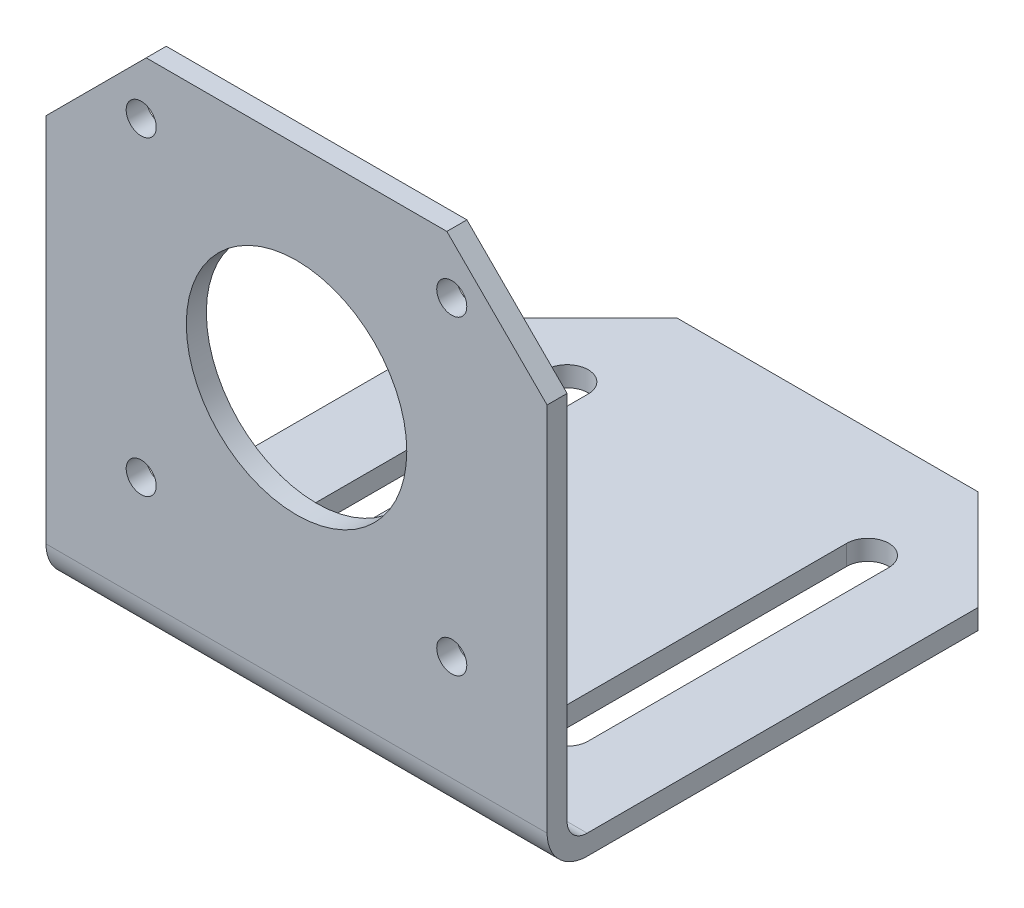
ISO-10303-21;
HEADER;
FILE_DESCRIPTION(('STEP AP214'),'2;1');
FILE_NAME('part.step','',(''),(''),'','','');
FILE_SCHEMA(('AUTOMOTIVE_DESIGN { 1 0 10303 214 1 1 1 1 }'));
ENDSEC;
DATA;
#1=APPLICATION_CONTEXT('core data for automotive mechanical design processes');
#2=APPLICATION_PROTOCOL_DEFINITION('international standard','automotive_design',2000,#1);
#3=PRODUCT_CONTEXT('',#1,'mechanical');
#4=PRODUCT('Part','Part','',(#3));
#5=PRODUCT_RELATED_PRODUCT_CATEGORY('part','',(#4));
#6=PRODUCT_DEFINITION_FORMATION('','',#4);
#7=PRODUCT_DEFINITION_CONTEXT('part definition',#1,'design');
#8=PRODUCT_DEFINITION('design','',#6,#7);
#9=PRODUCT_DEFINITION_SHAPE('','',#8);
#10=(LENGTH_UNIT() NAMED_UNIT(*) SI_UNIT(.MILLI.,.METRE.));
#11=(NAMED_UNIT(*) PLANE_ANGLE_UNIT() SI_UNIT($,.RADIAN.));
#12=(NAMED_UNIT(*) SI_UNIT($,.STERADIAN.) SOLID_ANGLE_UNIT());
#13=UNCERTAINTY_MEASURE_WITH_UNIT(LENGTH_MEASURE(1.E-05),#10,'distance_accuracy_value','');
#14=(GEOMETRIC_REPRESENTATION_CONTEXT(3) GLOBAL_UNCERTAINTY_ASSIGNED_CONTEXT((#13)) GLOBAL_UNIT_ASSIGNED_CONTEXT((#10,
#11,#12)) REPRESENTATION_CONTEXT('',''));
#15=CARTESIAN_POINT('',(0.,0.,0.));
#16=DIRECTION('',(0.,0.,1.));
#17=DIRECTION('',(1.,0.,0.));
#18=AXIS2_PLACEMENT_3D('',#15,#16,#17);
#19=CARTESIAN_POINT('',(50.,4.,-4.));
#20=DIRECTION('',(-1.,0.,0.));
#21=DIRECTION('',(0.,0.,1.));
#22=AXIS2_PLACEMENT_3D('',#19,#20,#21);
#23=CYLINDRICAL_SURFACE('',#22,4.);
#24=CARTESIAN_POINT('',(0.,4.,-4.));
#25=DIRECTION('',(-1.,0.,0.));
#26=DIRECTION('',(0.,0.,1.));
#27=AXIS2_PLACEMENT_3D('',#24,#25,#26);
#28=CIRCLE('',#27,4.);
#29=CARTESIAN_POINT('',(0.,0.,-4.00000000000003));
#30=VERTEX_POINT('',#29);
#31=CARTESIAN_POINT('',(0.,4.00000000000003,0.));
#32=VERTEX_POINT('',#31);
#33=EDGE_CURVE('E190',#30,#32,#28,.T.);
#34=ORIENTED_EDGE('',*,*,#33,.F.);
#35=DIRECTION('',(-1.,0.,0.));
#36=VECTOR('',#35,1.);
#37=CARTESIAN_POINT('',(50.,0.,-4.00000000000003));
#38=LINE('',#37,#36);
#39=CARTESIAN_POINT('',(50.,0.,-4.00000000000003));
#40=VERTEX_POINT('',#39);
#41=EDGE_CURVE('E11',#40,#30,#38,.T.);
#42=ORIENTED_EDGE('',*,*,#41,.F.);
#43=CARTESIAN_POINT('',(50.,4.,-4.));
#44=DIRECTION('',(-1.,0.,0.));
#45=DIRECTION('',(0.,0.,1.));
#46=AXIS2_PLACEMENT_3D('',#43,#44,#45);
#47=CIRCLE('',#46,4.);
#48=CARTESIAN_POINT('',(50.,4.00000000000003,0.));
#49=VERTEX_POINT('',#48);
#50=EDGE_CURVE('E206',#40,#49,#47,.T.);
#51=ORIENTED_EDGE('',*,*,#50,.T.);
#52=DIRECTION('',(-1.,0.,0.));
#53=VECTOR('',#52,1.);
#54=CARTESIAN_POINT('',(50.,4.00000000000003,0.));
#55=LINE('',#54,#53);
#56=EDGE_CURVE('E36',#49,#32,#55,.T.);
#57=ORIENTED_EDGE('',*,*,#56,.T.);
#58=EDGE_LOOP('',(#34,#42,#51,#57));
#59=FACE_BOUND('',#58,.T.);
#60=ADVANCED_FACE('F33',(#59),#23,.T.);
#61=CARTESIAN_POINT('',(50.,0.,-4.00000000000003));
#62=DIRECTION('',(0.,1.,0.));
#63=DIRECTION('',(0.,0.,1.));
#64=AXIS2_PLACEMENT_3D('',#61,#62,#63);
#65=PLANE('',#64);
#66=DIRECTION('',(0.,0.,1.));
#67=VECTOR('',#66,1.);
#68=CARTESIAN_POINT('',(12.1,0.,-42.));
#69=LINE('',#68,#67);
#70=CARTESIAN_POINT('',(12.1,0.,-42.));
#71=VERTEX_POINT('',#70);
#72=CARTESIAN_POINT('',(12.1,0.,-12.));
#73=VERTEX_POINT('',#72);
#74=EDGE_CURVE('E323',#71,#73,#69,.T.);
#75=ORIENTED_EDGE('',*,*,#74,.F.);
#76=CARTESIAN_POINT('',(9.99999999999999,0.,-41.9999999999999));
#77=DIRECTION('',(0.,1.,0.));
#78=DIRECTION('',(0.,0.,1.));
#79=AXIS2_PLACEMENT_3D('',#76,#77,#78);
#80=CIRCLE('',#79,2.1);
#81=CARTESIAN_POINT('',(7.9,0.,-42.));
#82=VERTEX_POINT('',#81);
#83=EDGE_CURVE('E299',#82,#71,#80,.F.);
#84=ORIENTED_EDGE('',*,*,#83,.F.);
#85=DIRECTION('',(0.,0.,-1.));
#86=VECTOR('',#85,1.);
#87=CARTESIAN_POINT('',(7.9,0.,-42.));
#88=LINE('',#87,#86);
#89=CARTESIAN_POINT('',(7.89999999999999,0.,-12.));
#90=VERTEX_POINT('',#89);
#91=EDGE_CURVE('E292',#90,#82,#88,.T.);
#92=ORIENTED_EDGE('',*,*,#91,.F.);
#93=CARTESIAN_POINT('',(9.99999999999999,0.,-12.));
#94=DIRECTION('',(0.,1.,0.));
#95=DIRECTION('',(0.,0.,1.));
#96=AXIS2_PLACEMENT_3D('',#93,#94,#95);
#97=CIRCLE('',#96,2.10000000000001);
#98=EDGE_CURVE('E310',#73,#90,#97,.F.);
#99=ORIENTED_EDGE('',*,*,#98,.F.);
#100=EDGE_LOOP('',(#75,#84,#92,#99));
#101=FACE_BOUND('',#100,.T.);
#102=DIRECTION('',(0.,0.,1.));
#103=VECTOR('',#102,1.);
#104=CARTESIAN_POINT('',(42.1,0.,-42.));
#105=LINE('',#104,#103);
#106=CARTESIAN_POINT('',(42.1,0.,-42.));
#107=VERTEX_POINT('',#106);
#108=CARTESIAN_POINT('',(42.1,0.,-12.));
#109=VERTEX_POINT('',#108);
#110=EDGE_CURVE('E294',#107,#109,#105,.T.);
#111=ORIENTED_EDGE('',*,*,#110,.F.);
#112=CARTESIAN_POINT('',(40.,0.,-41.9999999999999));
#113=DIRECTION('',(0.,1.,0.));
#114=DIRECTION('',(0.,0.,1.));
#115=AXIS2_PLACEMENT_3D('',#112,#113,#114);
#116=CIRCLE('',#115,2.1);
#117=CARTESIAN_POINT('',(37.9,0.,-42.));
#118=VERTEX_POINT('',#117);
#119=EDGE_CURVE('E270',#118,#107,#116,.F.);
#120=ORIENTED_EDGE('',*,*,#119,.F.);
#121=DIRECTION('',(0.,0.,-1.));
#122=VECTOR('',#121,1.);
#123=CARTESIAN_POINT('',(37.9,0.,-42.));
#124=LINE('',#123,#122);
#125=CARTESIAN_POINT('',(37.9,0.,-12.));
#126=VERTEX_POINT('',#125);
#127=EDGE_CURVE('E252',#126,#118,#124,.T.);
#128=ORIENTED_EDGE('',*,*,#127,.F.);
#129=CARTESIAN_POINT('',(40.,0.,-12.));
#130=DIRECTION('',(0.,1.,0.));
#131=DIRECTION('',(0.,0.,1.));
#132=AXIS2_PLACEMENT_3D('',#129,#130,#131);
#133=CIRCLE('',#132,2.10000000000001);
#134=EDGE_CURVE('E281',#109,#126,#133,.F.);
#135=ORIENTED_EDGE('',*,*,#134,.F.);
#136=EDGE_LOOP('',(#111,#120,#128,#135));
#137=FACE_BOUND('',#136,.T.);
#138=DIRECTION('',(-1.,0.,0.));
#139=VECTOR('',#138,1.);
#140=CARTESIAN_POINT('',(50.,0.,-52.9999999999999));
#141=LINE('',#140,#139);
#142=CARTESIAN_POINT('',(40.,0.,-52.9999999999999));
#143=VERTEX_POINT('',#142);
#144=CARTESIAN_POINT('',(10.,0.,-52.9999999999999));
#145=VERTEX_POINT('',#144);
#146=EDGE_CURVE('E41',#143,#145,#141,.T.);
#147=ORIENTED_EDGE('',*,*,#146,.F.);
#148=DIRECTION('',(-0.707106781186548,0.,-0.707106781186548));
#149=VECTOR('',#148,1.);
#150=CARTESIAN_POINT('',(46.5,0.,-46.5));
#151=LINE('',#150,#149);
#152=CARTESIAN_POINT('',(50.,0.,-42.9999999999999));
#153=VERTEX_POINT('',#152);
#154=EDGE_CURVE('E336',#153,#143,#151,.T.);
#155=ORIENTED_EDGE('',*,*,#154,.F.);
#156=DIRECTION('',(0.,0.,-1.));
#157=VECTOR('',#156,1.);
#158=CARTESIAN_POINT('',(50.,0.,-4.00000000000003));
#159=LINE('',#158,#157);
#160=EDGE_CURVE('E218',#40,#153,#159,.T.);
#161=ORIENTED_EDGE('',*,*,#160,.F.);
#162=ORIENTED_EDGE('',*,*,#41,.T.);
#163=DIRECTION('',(0.,0.,-1.));
#164=VECTOR('',#163,1.);
#165=CARTESIAN_POINT('',(0.,0.,-4.00000000000003));
#166=LINE('',#165,#164);
#167=CARTESIAN_POINT('',(0.,0.,-42.9999999999999));
#168=VERTEX_POINT('',#167);
#169=EDGE_CURVE('E204',#30,#168,#166,.T.);
#170=ORIENTED_EDGE('',*,*,#169,.T.);
#171=DIRECTION('',(-0.707106781186548,0.,0.707106781186548));
#172=VECTOR('',#171,1.);
#173=CARTESIAN_POINT('',(-21.5,0.,-21.5));
#174=LINE('',#173,#172);
#175=EDGE_CURVE('E321',#145,#168,#174,.T.);
#176=ORIENTED_EDGE('',*,*,#175,.F.);
#177=EDGE_LOOP('',(#147,#155,#161,#162,#170,#176));
#178=FACE_BOUND('',#177,.T.);
#179=ADVANCED_FACE('F367',(#101,#137,#178),#65,.F.);
#180=CARTESIAN_POINT('',(50.,0.,-52.9999999999999));
#181=DIRECTION('',(0.,0.,1.));
#182=DIRECTION('',(1.,0.,0.));
#183=AXIS2_PLACEMENT_3D('',#180,#181,#182);
#184=PLANE('',#183);
#185=DIRECTION('',(-1.,0.,0.));
#186=VECTOR('',#185,1.);
#187=CARTESIAN_POINT('',(50.,2.,-52.9999999999999));
#188=LINE('',#187,#186);
#189=CARTESIAN_POINT('',(40.,2.,-52.9999999999999));
#190=VERTEX_POINT('',#189);
#191=CARTESIAN_POINT('',(10.,2.,-52.9999999999999));
#192=VERTEX_POINT('',#191);
#193=EDGE_CURVE('E209',#190,#192,#188,.T.);
#194=ORIENTED_EDGE('',*,*,#193,.F.);
#195=DIRECTION('',(0.,1.,0.));
#196=VECTOR('',#195,1.);
#197=CARTESIAN_POINT('',(40.,-14.142135623731,-52.9999999999999));
#198=LINE('',#197,#196);
#199=EDGE_CURVE('E339',#143,#190,#198,.T.);
#200=ORIENTED_EDGE('',*,*,#199,.F.);
#201=ORIENTED_EDGE('',*,*,#146,.T.);
#202=DIRECTION('',(0.,1.,0.));
#203=VECTOR('',#202,1.);
#204=CARTESIAN_POINT('',(10.,-14.142135623731,-52.9999999999999));
#205=LINE('',#204,#203);
#206=EDGE_CURVE('E328',#145,#192,#205,.T.);
#207=ORIENTED_EDGE('',*,*,#206,.T.);
#208=EDGE_LOOP('',(#194,#200,#201,#207));
#209=FACE_BOUND('',#208,.T.);
#210=ADVANCED_FACE('F375',(#209),#184,.F.);
#211=CARTESIAN_POINT('',(50.,2.,-4.00000000000001));
#212=DIRECTION('',(0.,1.,0.));
#213=DIRECTION('',(0.,0.,1.));
#214=AXIS2_PLACEMENT_3D('',#211,#212,#213);
#215=PLANE('',#214);
#216=DIRECTION('',(0.707106781186548,0.,0.707106781186548));
#217=VECTOR('',#216,1.);
#218=CARTESIAN_POINT('',(46.5,2.,-46.5));
#219=LINE('',#218,#217);
#220=CARTESIAN_POINT('',(50.,2.,-42.9999999999999));
#221=VERTEX_POINT('',#220);
#222=EDGE_CURVE('E341',#190,#221,#219,.T.);
#223=ORIENTED_EDGE('',*,*,#222,.F.);
#224=ORIENTED_EDGE('',*,*,#193,.T.);
#225=DIRECTION('',(0.707106781186548,0.,-0.707106781186548));
#226=VECTOR('',#225,1.);
#227=CARTESIAN_POINT('',(-21.5,2.,-21.5));
#228=LINE('',#227,#226);
#229=CARTESIAN_POINT('',(0.,2.,-42.9999999999999));
#230=VERTEX_POINT('',#229);
#231=EDGE_CURVE('E331',#230,#192,#228,.T.);
#232=ORIENTED_EDGE('',*,*,#231,.F.);
#233=DIRECTION('',(0.,0.,-1.));
#234=VECTOR('',#233,1.);
#235=CARTESIAN_POINT('',(0.,2.,-4.00000000000001));
#236=LINE('',#235,#234);
#237=CARTESIAN_POINT('',(0.,2.,-4.00000000000001));
#238=VERTEX_POINT('',#237);
#239=EDGE_CURVE('E201',#238,#230,#236,.T.);
#240=ORIENTED_EDGE('',*,*,#239,.F.);
#241=DIRECTION('',(-1.,0.,0.));
#242=VECTOR('',#241,1.);
#243=CARTESIAN_POINT('',(50.,2.,-4.00000000000001));
#244=LINE('',#243,#242);
#245=CARTESIAN_POINT('',(50.,2.,-4.00000000000001));
#246=VERTEX_POINT('',#245);
#247=EDGE_CURVE('E211',#246,#238,#244,.T.);
#248=ORIENTED_EDGE('',*,*,#247,.F.);
#249=DIRECTION('',(0.,0.,-1.));
#250=VECTOR('',#249,1.);
#251=CARTESIAN_POINT('',(50.,2.,-4.00000000000001));
#252=LINE('',#251,#250);
#253=EDGE_CURVE('E222',#246,#221,#252,.T.);
#254=ORIENTED_EDGE('',*,*,#253,.T.);
#255=EDGE_LOOP('',(#223,#224,#232,#240,#248,#254));
#256=FACE_BOUND('',#255,.T.);
#257=CARTESIAN_POINT('',(9.99999999999999,2.,-41.9999999999999));
#258=DIRECTION('',(0.,1.,0.));
#259=DIRECTION('',(0.,0.,-1.));
#260=AXIS2_PLACEMENT_3D('',#257,#258,#259);
#261=CIRCLE('',#260,2.1);
#262=CARTESIAN_POINT('',(12.1,2.,-42.));
#263=VERTEX_POINT('',#262);
#264=CARTESIAN_POINT('',(7.9,2.,-42.));
#265=VERTEX_POINT('',#264);
#266=EDGE_CURVE('E319',#263,#265,#261,.T.);
#267=ORIENTED_EDGE('',*,*,#266,.F.);
#268=DIRECTION('',(0.,0.,-1.));
#269=VECTOR('',#268,1.);
#270=CARTESIAN_POINT('',(12.1,2.,-42.));
#271=LINE('',#270,#269);
#272=CARTESIAN_POINT('',(12.1,2.,-12.));
#273=VERTEX_POINT('',#272);
#274=EDGE_CURVE('E304',#273,#263,#271,.T.);
#275=ORIENTED_EDGE('',*,*,#274,.F.);
#276=CARTESIAN_POINT('',(9.99999999999999,2.,-12.));
#277=DIRECTION('',(0.,1.,0.));
#278=DIRECTION('',(0.,0.,-1.));
#279=AXIS2_PLACEMENT_3D('',#276,#277,#278);
#280=CIRCLE('',#279,2.10000000000001);
#281=CARTESIAN_POINT('',(7.89999999999999,2.,-12.));
#282=VERTEX_POINT('',#281);
#283=EDGE_CURVE('E313',#282,#273,#280,.T.);
#284=ORIENTED_EDGE('',*,*,#283,.F.);
#285=DIRECTION('',(0.,0.,1.));
#286=VECTOR('',#285,1.);
#287=CARTESIAN_POINT('',(7.9,2.,-42.));
#288=LINE('',#287,#286);
#289=EDGE_CURVE('E316',#265,#282,#288,.T.);
#290=ORIENTED_EDGE('',*,*,#289,.F.);
#291=EDGE_LOOP('',(#267,#275,#284,#290));
#292=FACE_BOUND('',#291,.T.);
#293=CARTESIAN_POINT('',(40.,2.,-41.9999999999999));
#294=DIRECTION('',(0.,1.,0.));
#295=DIRECTION('',(0.,0.,1.));
#296=AXIS2_PLACEMENT_3D('',#293,#294,#295);
#297=CIRCLE('',#296,2.1);
#298=CARTESIAN_POINT('',(42.1,2.,-42.));
#299=VERTEX_POINT('',#298);
#300=CARTESIAN_POINT('',(37.9,2.,-42.));
#301=VERTEX_POINT('',#300);
#302=EDGE_CURVE('E290',#299,#301,#297,.T.);
#303=ORIENTED_EDGE('',*,*,#302,.F.);
#304=DIRECTION('',(0.,0.,-1.));
#305=VECTOR('',#304,1.);
#306=CARTESIAN_POINT('',(42.1,2.,-42.));
#307=LINE('',#306,#305);
#308=CARTESIAN_POINT('',(42.1,2.,-12.));
#309=VERTEX_POINT('',#308);
#310=EDGE_CURVE('E275',#309,#299,#307,.T.);
#311=ORIENTED_EDGE('',*,*,#310,.F.);
#312=CARTESIAN_POINT('',(40.,2.,-12.));
#313=DIRECTION('',(0.,1.,0.));
#314=DIRECTION('',(0.,0.,1.));
#315=AXIS2_PLACEMENT_3D('',#312,#313,#314);
#316=CIRCLE('',#315,2.10000000000001);
#317=CARTESIAN_POINT('',(37.9,2.,-12.));
#318=VERTEX_POINT('',#317);
#319=EDGE_CURVE('E284',#318,#309,#316,.T.);
#320=ORIENTED_EDGE('',*,*,#319,.F.);
#321=DIRECTION('',(0.,0.,1.));
#322=VECTOR('',#321,1.);
#323=CARTESIAN_POINT('',(37.9,2.,-42.));
#324=LINE('',#323,#322);
#325=EDGE_CURVE('E287',#301,#318,#324,.T.);
#326=ORIENTED_EDGE('',*,*,#325,.F.);
#327=EDGE_LOOP('',(#303,#311,#320,#326));
#328=FACE_BOUND('',#327,.T.);
#329=ADVANCED_FACE('F379',(#256,#292,#328),#215,.T.);
#330=CARTESIAN_POINT('',(50.,4.,-4.));
#331=DIRECTION('',(-1.,0.,0.));
#332=DIRECTION('',(0.,0.,1.));
#333=AXIS2_PLACEMENT_3D('',#330,#331,#332);
#334=CYLINDRICAL_SURFACE('',#333,2.);
#335=CARTESIAN_POINT('',(0.,4.,-4.));
#336=DIRECTION('',(1.,0.,0.));
#337=DIRECTION('',(0.,0.,-1.));
#338=AXIS2_PLACEMENT_3D('',#335,#336,#337);
#339=CIRCLE('',#338,2.);
#340=CARTESIAN_POINT('',(0.,4.00000000000001,-2.));
#341=VERTEX_POINT('',#340);
#342=EDGE_CURVE('E193',#341,#238,#339,.T.);
#343=ORIENTED_EDGE('',*,*,#342,.F.);
#344=DIRECTION('',(-1.,0.,0.));
#345=VECTOR('',#344,1.);
#346=CARTESIAN_POINT('',(50.,4.00000000000001,-2.));
#347=LINE('',#346,#345);
#348=CARTESIAN_POINT('',(50.,4.00000000000001,-2.));
#349=VERTEX_POINT('',#348);
#350=EDGE_CURVE('E213',#349,#341,#347,.T.);
#351=ORIENTED_EDGE('',*,*,#350,.F.);
#352=CARTESIAN_POINT('',(50.,4.,-4.));
#353=DIRECTION('',(1.,0.,0.));
#354=DIRECTION('',(0.,0.,-1.));
#355=AXIS2_PLACEMENT_3D('',#352,#353,#354);
#356=CIRCLE('',#355,2.);
#357=EDGE_CURVE('E228',#349,#246,#356,.T.);
#358=ORIENTED_EDGE('',*,*,#357,.T.);
#359=ORIENTED_EDGE('',*,*,#247,.T.);
#360=EDGE_LOOP('',(#343,#351,#358,#359));
#361=FACE_BOUND('',#360,.T.);
#362=ADVANCED_FACE('F390',(#361),#334,.F.);
#363=CARTESIAN_POINT('',(50.,51.,-2.));
#364=DIRECTION('',(0.,0.,-1.));
#365=DIRECTION('',(-1.,0.,0.));
#366=AXIS2_PLACEMENT_3D('',#363,#364,#365);
#367=PLANE('',#366);
#368=DIRECTION('',(-0.707106781186547,-0.707106781186548,0.));
#369=VECTOR('',#368,1.);
#370=CARTESIAN_POINT('',(10.,51.,-2.));
#371=LINE('',#370,#369);
#372=CARTESIAN_POINT('',(10.,51.,-2.));
#373=VERTEX_POINT('',#372);
#374=CARTESIAN_POINT('',(0.,41.,-2.));
#375=VERTEX_POINT('',#374);
#376=EDGE_CURVE('E49',#373,#375,#371,.T.);
#377=ORIENTED_EDGE('',*,*,#376,.F.);
#378=DIRECTION('',(-1.,0.,0.));
#379=VECTOR('',#378,1.);
#380=CARTESIAN_POINT('',(50.,51.,-2.));
#381=LINE('',#380,#379);
#382=CARTESIAN_POINT('',(40.,51.,-2.));
#383=VERTEX_POINT('',#382);
#384=EDGE_CURVE('E216',#383,#373,#381,.T.);
#385=ORIENTED_EDGE('',*,*,#384,.F.);
#386=DIRECTION('',(-0.707106781186548,0.707106781186548,0.));
#387=VECTOR('',#386,1.);
#388=CARTESIAN_POINT('',(50.,41.,-2.));
#389=LINE('',#388,#387);
#390=CARTESIAN_POINT('',(50.,41.,-2.));
#391=VERTEX_POINT('',#390);
#392=EDGE_CURVE('E347',#391,#383,#389,.T.);
#393=ORIENTED_EDGE('',*,*,#392,.F.);
#394=DIRECTION('',(0.,-1.,0.));
#395=VECTOR('',#394,1.);
#396=CARTESIAN_POINT('',(50.,51.,-2.));
#397=LINE('',#396,#395);
#398=EDGE_CURVE('E233',#391,#349,#397,.T.);
#399=ORIENTED_EDGE('',*,*,#398,.T.);
#400=ORIENTED_EDGE('',*,*,#350,.T.);
#401=DIRECTION('',(0.,-1.,0.));
#402=VECTOR('',#401,1.);
#403=CARTESIAN_POINT('',(0.,51.,-2.));
#404=LINE('',#403,#402);
#405=EDGE_CURVE('E191',#375,#341,#404,.T.);
#406=ORIENTED_EDGE('',*,*,#405,.F.);
#407=EDGE_LOOP('',(#377,#385,#393,#399,#400,#406));
#408=FACE_BOUND('',#407,.T.);
#409=CARTESIAN_POINT('',(9.5,45.5,-2.));
#410=DIRECTION('',(0.,0.,-1.));
#411=DIRECTION('',(-1.,0.,0.));
#412=AXIS2_PLACEMENT_3D('',#409,#410,#411);
#413=CIRCLE('',#412,1.5);
#414=CARTESIAN_POINT('',(8.,45.5,-2.));
#415=VERTEX_POINT('',#414);
#416=EDGE_CURVE('E262',#415,#415,#413,.T.);
#417=ORIENTED_EDGE('',*,*,#416,.F.);
#418=EDGE_LOOP('',(#417));
#419=FACE_BOUND('',#418,.T.);
#420=CARTESIAN_POINT('',(40.488,45.4999999999998,-2.));
#421=DIRECTION('',(0.,0.,-1.));
#422=DIRECTION('',(-1.,0.,0.));
#423=AXIS2_PLACEMENT_3D('',#420,#421,#422);
#424=CIRCLE('',#423,1.5);
#425=CARTESIAN_POINT('',(38.988,45.4999999999998,-2.));
#426=VERTEX_POINT('',#425);
#427=EDGE_CURVE('E256',#426,#426,#424,.T.);
#428=ORIENTED_EDGE('',*,*,#427,.F.);
#429=EDGE_LOOP('',(#428));
#430=FACE_BOUND('',#429,.T.);
#431=CARTESIAN_POINT('',(40.4879999999997,14.4999999999998,-2.));
#432=DIRECTION('',(0.,0.,-1.));
#433=DIRECTION('',(-1.,0.,0.));
#434=AXIS2_PLACEMENT_3D('',#431,#432,#433);
#435=CIRCLE('',#434,1.5);
#436=CARTESIAN_POINT('',(38.9879999999997,14.4999999999998,-2.));
#437=VERTEX_POINT('',#436);
#438=EDGE_CURVE('E248',#437,#437,#435,.T.);
#439=ORIENTED_EDGE('',*,*,#438,.F.);
#440=EDGE_LOOP('',(#439));
#441=FACE_BOUND('',#440,.T.);
#442=CARTESIAN_POINT('',(9.49999999999967,14.5,-2.));
#443=DIRECTION('',(0.,0.,-1.));
#444=DIRECTION('',(-1.,0.,0.));
#445=AXIS2_PLACEMENT_3D('',#442,#443,#444);
#446=CIRCLE('',#445,1.5);
#447=CARTESIAN_POINT('',(7.99999999999967,14.5,-2.));
#448=VERTEX_POINT('',#447);
#449=EDGE_CURVE('E249',#448,#448,#446,.T.);
#450=ORIENTED_EDGE('',*,*,#449,.F.);
#451=EDGE_LOOP('',(#450));
#452=FACE_BOUND('',#451,.T.);
#453=CARTESIAN_POINT('',(25.,30.,-2.));
#454=DIRECTION('',(0.,0.,-1.));
#455=DIRECTION('',(-1.,0.,0.));
#456=AXIS2_PLACEMENT_3D('',#453,#454,#455);
#457=CIRCLE('',#456,11.);
#458=CARTESIAN_POINT('',(14.,30.,-2.));
#459=VERTEX_POINT('',#458);
#460=EDGE_CURVE('E241',#459,#459,#457,.T.);
#461=ORIENTED_EDGE('',*,*,#460,.F.);
#462=EDGE_LOOP('',(#461));
#463=FACE_BOUND('',#462,.T.);
#464=ADVANCED_FACE('F356',(#408,#419,#430,#441,#452,#463),#367,.T.);
#465=CARTESIAN_POINT('',(50.,51.,0.));
#466=DIRECTION('',(0.,1.,0.));
#467=DIRECTION('',(0.,0.,1.));
#468=AXIS2_PLACEMENT_3D('',#465,#466,#467);
#469=PLANE('',#468);
#470=DIRECTION('',(0.,0.,-1.));
#471=VECTOR('',#470,1.);
#472=CARTESIAN_POINT('',(10.,51.,14.142135623731));
#473=LINE('',#472,#471);
#474=CARTESIAN_POINT('',(10.,51.,0.));
#475=VERTEX_POINT('',#474);
#476=EDGE_CURVE('E175',#475,#373,#473,.T.);
#477=ORIENTED_EDGE('',*,*,#476,.F.);
#478=DIRECTION('',(-1.,0.,0.));
#479=VECTOR('',#478,1.);
#480=CARTESIAN_POINT('',(50.,51.,0.));
#481=LINE('',#480,#479);
#482=CARTESIAN_POINT('',(40.,51.,0.));
#483=VERTEX_POINT('',#482);
#484=EDGE_CURVE('E185',#483,#475,#481,.T.);
#485=ORIENTED_EDGE('',*,*,#484,.F.);
#486=DIRECTION('',(0.,0.,-1.));
#487=VECTOR('',#486,1.);
#488=CARTESIAN_POINT('',(40.,51.,14.142135623731));
#489=LINE('',#488,#487);
#490=EDGE_CURVE('E344',#483,#383,#489,.T.);
#491=ORIENTED_EDGE('',*,*,#490,.T.);
#492=ORIENTED_EDGE('',*,*,#384,.T.);
#493=EDGE_LOOP('',(#477,#485,#491,#492));
#494=FACE_BOUND('',#493,.T.);
#495=ADVANCED_FACE('F359',(#494),#469,.T.);
#496=CARTESIAN_POINT('',(50.,4.00000000000003,0.));
#497=DIRECTION('',(0.,0.,1.));
#498=DIRECTION('',(1.,0.,0.));
#499=AXIS2_PLACEMENT_3D('',#496,#497,#498);
#500=PLANE('',#499);
#501=DIRECTION('',(-0.707106781186547,-0.707106781186548,0.));
#502=VECTOR('',#501,1.);
#503=CARTESIAN_POINT('',(10.,51.,0.));
#504=LINE('',#503,#502);
#505=CARTESIAN_POINT('',(0.,41.,0.));
#506=VERTEX_POINT('',#505);
#507=EDGE_CURVE('E170',#475,#506,#504,.T.);
#508=ORIENTED_EDGE('',*,*,#507,.T.);
#509=DIRECTION('',(0.,1.,0.));
#510=VECTOR('',#509,1.);
#511=CARTESIAN_POINT('',(0.,4.00000000000003,0.));
#512=LINE('',#511,#510);
#513=EDGE_CURVE('E182',#32,#506,#512,.T.);
#514=ORIENTED_EDGE('',*,*,#513,.F.);
#515=ORIENTED_EDGE('',*,*,#56,.F.);
#516=DIRECTION('',(0.,1.,0.));
#517=VECTOR('',#516,1.);
#518=CARTESIAN_POINT('',(50.,4.00000000000003,0.));
#519=LINE('',#518,#517);
#520=CARTESIAN_POINT('',(50.,41.,0.));
#521=VERTEX_POINT('',#520);
#522=EDGE_CURVE('E235',#49,#521,#519,.T.);
#523=ORIENTED_EDGE('',*,*,#522,.T.);
#524=DIRECTION('',(-0.707106781186548,0.707106781186548,0.));
#525=VECTOR('',#524,1.);
#526=CARTESIAN_POINT('',(50.,41.,0.));
#527=LINE('',#526,#525);
#528=EDGE_CURVE('E57',#521,#483,#527,.T.);
#529=ORIENTED_EDGE('',*,*,#528,.T.);
#530=ORIENTED_EDGE('',*,*,#484,.T.);
#531=EDGE_LOOP('',(#508,#514,#515,#523,#529,#530));
#532=FACE_BOUND('',#531,.T.);
#533=CARTESIAN_POINT('',(9.5,45.5,0.));
#534=DIRECTION('',(0.,0.,1.));
#535=DIRECTION('',(1.,0.,0.));
#536=AXIS2_PLACEMENT_3D('',#533,#534,#535);
#537=CIRCLE('',#536,1.5);
#538=CARTESIAN_POINT('',(11.,45.5,0.));
#539=VERTEX_POINT('',#538);
#540=EDGE_CURVE('E244',#539,#539,#537,.F.);
#541=ORIENTED_EDGE('',*,*,#540,.T.);
#542=EDGE_LOOP('',(#541));
#543=FACE_BOUND('',#542,.T.);
#544=CARTESIAN_POINT('',(40.488,45.4999999999998,0.));
#545=DIRECTION('',(0.,0.,1.));
#546=DIRECTION('',(1.,0.,0.));
#547=AXIS2_PLACEMENT_3D('',#544,#545,#546);
#548=CIRCLE('',#547,1.5);
#549=CARTESIAN_POINT('',(41.988,45.4999999999998,0.));
#550=VERTEX_POINT('',#549);
#551=EDGE_CURVE('E259',#550,#550,#548,.F.);
#552=ORIENTED_EDGE('',*,*,#551,.T.);
#553=EDGE_LOOP('',(#552));
#554=FACE_BOUND('',#553,.T.);
#555=CARTESIAN_POINT('',(40.4879999999997,14.4999999999998,0.));
#556=DIRECTION('',(0.,0.,1.));
#557=DIRECTION('',(1.,0.,0.));
#558=AXIS2_PLACEMENT_3D('',#555,#556,#557);
#559=CIRCLE('',#558,1.5);
#560=CARTESIAN_POINT('',(41.9879999999997,14.4999999999998,0.));
#561=VERTEX_POINT('',#560);
#562=EDGE_CURVE('E253',#561,#561,#559,.F.);
#563=ORIENTED_EDGE('',*,*,#562,.T.);
#564=EDGE_LOOP('',(#563));
#565=FACE_BOUND('',#564,.T.);
#566=CARTESIAN_POINT('',(9.49999999999967,14.5,0.));
#567=DIRECTION('',(0.,0.,1.));
#568=DIRECTION('',(1.,0.,0.));
#569=AXIS2_PLACEMENT_3D('',#566,#567,#568);
#570=CIRCLE('',#569,1.5);
#571=CARTESIAN_POINT('',(10.9999999999997,14.5,0.));
#572=VERTEX_POINT('',#571);
#573=EDGE_CURVE('E245',#572,#572,#570,.F.);
#574=ORIENTED_EDGE('',*,*,#573,.T.);
#575=EDGE_LOOP('',(#574));
#576=FACE_BOUND('',#575,.T.);
#577=CARTESIAN_POINT('',(25.,30.,0.));
#578=DIRECTION('',(0.,0.,1.));
#579=DIRECTION('',(1.,0.,0.));
#580=AXIS2_PLACEMENT_3D('',#577,#578,#579);
#581=CIRCLE('',#580,11.);
#582=CARTESIAN_POINT('',(36.,30.,0.));
#583=VERTEX_POINT('',#582);
#584=EDGE_CURVE('E195',#583,#583,#581,.F.);
#585=ORIENTED_EDGE('',*,*,#584,.T.);
#586=EDGE_LOOP('',(#585));
#587=FACE_BOUND('',#586,.T.);
#588=ADVANCED_FACE('F180',(#532,#543,#554,#565,#576,#587),#500,.T.);
#589=CARTESIAN_POINT('',(50.,4.,-4.));
#590=DIRECTION('',(-1.,0.,0.));
#591=DIRECTION('',(0.,0.,1.));
#592=AXIS2_PLACEMENT_3D('',#589,#590,#591);
#593=PLANE('',#592);
#594=ORIENTED_EDGE('',*,*,#398,.F.);
#595=DIRECTION('',(0.,0.,-1.));
#596=VECTOR('',#595,1.);
#597=CARTESIAN_POINT('',(50.,41.,14.142135623731));
#598=LINE('',#597,#596);
#599=EDGE_CURVE('E345',#521,#391,#598,.T.);
#600=ORIENTED_EDGE('',*,*,#599,.F.);
#601=ORIENTED_EDGE('',*,*,#522,.F.);
#602=ORIENTED_EDGE('',*,*,#50,.F.);
#603=ORIENTED_EDGE('',*,*,#160,.T.);
#604=DIRECTION('',(0.,1.,0.));
#605=VECTOR('',#604,1.);
#606=CARTESIAN_POINT('',(50.,-14.142135623731,-42.9999999999999));
#607=LINE('',#606,#605);
#608=EDGE_CURVE('E338',#153,#221,#607,.T.);
#609=ORIENTED_EDGE('',*,*,#608,.T.);
#610=ORIENTED_EDGE('',*,*,#253,.F.);
#611=ORIENTED_EDGE('',*,*,#357,.F.);
#612=EDGE_LOOP('',(#594,#600,#601,#602,#603,#609,#610,#611));
#613=FACE_BOUND('',#612,.T.);
#614=ADVANCED_FACE('F363',(#613),#593,.F.);
#615=CARTESIAN_POINT('',(0.,4.,-4.));
#616=DIRECTION('',(-1.,0.,0.));
#617=DIRECTION('',(0.,0.,1.));
#618=AXIS2_PLACEMENT_3D('',#615,#616,#617);
#619=PLANE('',#618);
#620=DIRECTION('',(0.,0.,-1.));
#621=VECTOR('',#620,1.);
#622=CARTESIAN_POINT('',(0.,41.,14.142135623731));
#623=LINE('',#622,#621);
#624=EDGE_CURVE('E167',#506,#375,#623,.T.);
#625=ORIENTED_EDGE('',*,*,#624,.T.);
#626=ORIENTED_EDGE('',*,*,#405,.T.);
#627=ORIENTED_EDGE('',*,*,#342,.T.);
#628=ORIENTED_EDGE('',*,*,#239,.T.);
#629=DIRECTION('',(0.,1.,0.));
#630=VECTOR('',#629,1.);
#631=CARTESIAN_POINT('',(0.,-14.142135623731,-42.9999999999999));
#632=LINE('',#631,#630);
#633=EDGE_CURVE('E329',#168,#230,#632,.T.);
#634=ORIENTED_EDGE('',*,*,#633,.F.);
#635=ORIENTED_EDGE('',*,*,#169,.F.);
#636=ORIENTED_EDGE('',*,*,#33,.T.);
#637=ORIENTED_EDGE('',*,*,#513,.T.);
#638=EDGE_LOOP('',(#625,#626,#627,#628,#634,#635,#636,#637));
#639=FACE_BOUND('',#638,.T.);
#640=ADVANCED_FACE('F187',(#639),#619,.T.);
#641=CARTESIAN_POINT('',(25.,30.,31.1126983722081));
#642=DIRECTION('',(0.,0.,-1.));
#643=DIRECTION('',(-1.,0.,0.));
#644=AXIS2_PLACEMENT_3D('',#641,#642,#643);
#645=CYLINDRICAL_SURFACE('',#644,11.);
#646=ORIENTED_EDGE('',*,*,#460,.T.);
#647=EDGE_LOOP('',(#646));
#648=FACE_BOUND('',#647,.T.);
#649=ORIENTED_EDGE('',*,*,#584,.F.);
#650=EDGE_LOOP('',(#649));
#651=FACE_BOUND('',#650,.T.);
#652=ADVANCED_FACE('F414',(#648,#651),#645,.F.);
#653=CARTESIAN_POINT('',(9.49999999999967,14.5,31.1126983722081));
#654=DIRECTION('',(0.,0.,-1.));
#655=DIRECTION('',(-1.,0.,0.));
#656=AXIS2_PLACEMENT_3D('',#653,#654,#655);
#657=CYLINDRICAL_SURFACE('',#656,1.5);
#658=ORIENTED_EDGE('',*,*,#449,.T.);
#659=EDGE_LOOP('',(#658));
#660=FACE_BOUND('',#659,.T.);
#661=ORIENTED_EDGE('',*,*,#573,.F.);
#662=EDGE_LOOP('',(#661));
#663=FACE_BOUND('',#662,.T.);
#664=ADVANCED_FACE('F419',(#660,#663),#657,.F.);
#665=CARTESIAN_POINT('',(40.4879999999997,14.4999999999998,31.1126983722081));
#666=DIRECTION('',(0.,0.,-1.));
#667=DIRECTION('',(-1.,0.,0.));
#668=AXIS2_PLACEMENT_3D('',#665,#666,#667);
#669=CYLINDRICAL_SURFACE('',#668,1.5);
#670=ORIENTED_EDGE('',*,*,#438,.T.);
#671=EDGE_LOOP('',(#670));
#672=FACE_BOUND('',#671,.T.);
#673=ORIENTED_EDGE('',*,*,#562,.F.);
#674=EDGE_LOOP('',(#673));
#675=FACE_BOUND('',#674,.T.);
#676=ADVANCED_FACE('F423',(#672,#675),#669,.F.);
#677=CARTESIAN_POINT('',(40.488,45.4999999999998,31.1126983722081));
#678=DIRECTION('',(0.,0.,-1.));
#679=DIRECTION('',(-1.,0.,0.));
#680=AXIS2_PLACEMENT_3D('',#677,#678,#679);
#681=CYLINDRICAL_SURFACE('',#680,1.5);
#682=ORIENTED_EDGE('',*,*,#427,.T.);
#683=EDGE_LOOP('',(#682));
#684=FACE_BOUND('',#683,.T.);
#685=ORIENTED_EDGE('',*,*,#551,.F.);
#686=EDGE_LOOP('',(#685));
#687=FACE_BOUND('',#686,.T.);
#688=ADVANCED_FACE('F427',(#684,#687),#681,.F.);
#689=CARTESIAN_POINT('',(9.5,45.5,31.1126983722081));
#690=DIRECTION('',(0.,0.,-1.));
#691=DIRECTION('',(-1.,0.,0.));
#692=AXIS2_PLACEMENT_3D('',#689,#690,#691);
#693=CYLINDRICAL_SURFACE('',#692,1.5);
#694=ORIENTED_EDGE('',*,*,#416,.T.);
#695=EDGE_LOOP('',(#694));
#696=FACE_BOUND('',#695,.T.);
#697=ORIENTED_EDGE('',*,*,#540,.F.);
#698=EDGE_LOOP('',(#697));
#699=FACE_BOUND('',#698,.T.);
#700=ADVANCED_FACE('F431',(#696,#699),#693,.F.);
#701=CARTESIAN_POINT('',(40.,-34.4569296368669,-41.9999999999999));
#702=DIRECTION('',(0.,1.,0.));
#703=DIRECTION('',(0.,0.,1.));
#704=AXIS2_PLACEMENT_3D('',#701,#702,#703);
#705=CYLINDRICAL_SURFACE('',#704,2.1);
#706=ORIENTED_EDGE('',*,*,#119,.T.);
#707=DIRECTION('',(0.,1.,0.));
#708=VECTOR('',#707,1.);
#709=CARTESIAN_POINT('',(42.1,-34.4569296368669,-42.));
#710=LINE('',#709,#708);
#711=EDGE_CURVE('E279',#107,#299,#710,.T.);
#712=ORIENTED_EDGE('',*,*,#711,.T.);
#713=ORIENTED_EDGE('',*,*,#302,.T.);
#714=DIRECTION('',(0.,1.,0.));
#715=VECTOR('',#714,1.);
#716=CARTESIAN_POINT('',(37.9,-34.4569296368669,-42.));
#717=LINE('',#716,#715);
#718=EDGE_CURVE('E271',#118,#301,#717,.T.);
#719=ORIENTED_EDGE('',*,*,#718,.F.);
#720=EDGE_LOOP('',(#706,#712,#713,#719));
#721=FACE_BOUND('',#720,.T.);
#722=ADVANCED_FACE('F435',(#721),#705,.F.);
#723=CARTESIAN_POINT('',(42.1,-34.4569296368669,-42.));
#724=DIRECTION('',(1.,0.,0.));
#725=DIRECTION('',(0.,0.,-1.));
#726=AXIS2_PLACEMENT_3D('',#723,#724,#725);
#727=PLANE('',#726);
#728=ORIENTED_EDGE('',*,*,#110,.T.);
#729=DIRECTION('',(0.,1.,0.));
#730=VECTOR('',#729,1.);
#731=CARTESIAN_POINT('',(42.1,-34.4569296368669,-12.));
#732=LINE('',#731,#730);
#733=EDGE_CURVE('E277',#109,#309,#732,.T.);
#734=ORIENTED_EDGE('',*,*,#733,.T.);
#735=ORIENTED_EDGE('',*,*,#310,.T.);
#736=ORIENTED_EDGE('',*,*,#711,.F.);
#737=EDGE_LOOP('',(#728,#734,#735,#736));
#738=FACE_BOUND('',#737,.T.);
#739=ADVANCED_FACE('F439',(#738),#727,.F.);
#740=CARTESIAN_POINT('',(40.,-34.4569296368669,-12.));
#741=DIRECTION('',(0.,1.,0.));
#742=DIRECTION('',(0.,0.,1.));
#743=AXIS2_PLACEMENT_3D('',#740,#741,#742);
#744=CYLINDRICAL_SURFACE('',#743,2.10000000000001);
#745=ORIENTED_EDGE('',*,*,#134,.T.);
#746=DIRECTION('',(0.,1.,0.));
#747=VECTOR('',#746,1.);
#748=CARTESIAN_POINT('',(37.9,-34.4569296368669,-12.));
#749=LINE('',#748,#747);
#750=EDGE_CURVE('E274',#126,#318,#749,.T.);
#751=ORIENTED_EDGE('',*,*,#750,.T.);
#752=ORIENTED_EDGE('',*,*,#319,.T.);
#753=ORIENTED_EDGE('',*,*,#733,.F.);
#754=EDGE_LOOP('',(#745,#751,#752,#753));
#755=FACE_BOUND('',#754,.T.);
#756=ADVANCED_FACE('F445',(#755),#744,.F.);
#757=CARTESIAN_POINT('',(37.9,-34.4569296368669,-42.));
#758=DIRECTION('',(-1.,0.,0.));
#759=DIRECTION('',(0.,0.,1.));
#760=AXIS2_PLACEMENT_3D('',#757,#758,#759);
#761=PLANE('',#760);
#762=ORIENTED_EDGE('',*,*,#127,.T.);
#763=ORIENTED_EDGE('',*,*,#718,.T.);
#764=ORIENTED_EDGE('',*,*,#325,.T.);
#765=ORIENTED_EDGE('',*,*,#750,.F.);
#766=EDGE_LOOP('',(#762,#763,#764,#765));
#767=FACE_BOUND('',#766,.T.);
#768=ADVANCED_FACE('F441',(#767),#761,.F.);
#769=CARTESIAN_POINT('',(9.99999999999999,-34.4569296368669,-41.9999999999999));
#770=DIRECTION('',(0.,1.,0.));
#771=DIRECTION('',(0.,0.,1.));
#772=AXIS2_PLACEMENT_3D('',#769,#770,#771);
#773=CYLINDRICAL_SURFACE('',#772,2.1);
#774=ORIENTED_EDGE('',*,*,#83,.T.);
#775=DIRECTION('',(0.,1.,0.));
#776=VECTOR('',#775,1.);
#777=CARTESIAN_POINT('',(12.1,-34.4569296368669,-42.));
#778=LINE('',#777,#776);
#779=EDGE_CURVE('E308',#71,#263,#778,.T.);
#780=ORIENTED_EDGE('',*,*,#779,.T.);
#781=ORIENTED_EDGE('',*,*,#266,.T.);
#782=DIRECTION('',(0.,1.,0.));
#783=VECTOR('',#782,1.);
#784=CARTESIAN_POINT('',(7.9,-34.4569296368669,-42.));
#785=LINE('',#784,#783);
#786=EDGE_CURVE('E300',#82,#265,#785,.T.);
#787=ORIENTED_EDGE('',*,*,#786,.F.);
#788=EDGE_LOOP('',(#774,#780,#781,#787));
#789=FACE_BOUND('',#788,.T.);
#790=ADVANCED_FACE('F444',(#789),#773,.F.);
#791=CARTESIAN_POINT('',(12.1,-34.4569296368669,-42.));
#792=DIRECTION('',(1.,0.,0.));
#793=DIRECTION('',(0.,0.,-1.));
#794=AXIS2_PLACEMENT_3D('',#791,#792,#793);
#795=PLANE('',#794);
#796=ORIENTED_EDGE('',*,*,#74,.T.);
#797=DIRECTION('',(0.,1.,0.));
#798=VECTOR('',#797,1.);
#799=CARTESIAN_POINT('',(12.1,-34.4569296368669,-12.));
#800=LINE('',#799,#798);
#801=EDGE_CURVE('E306',#73,#273,#800,.T.);
#802=ORIENTED_EDGE('',*,*,#801,.T.);
#803=ORIENTED_EDGE('',*,*,#274,.T.);
#804=ORIENTED_EDGE('',*,*,#779,.F.);
#805=EDGE_LOOP('',(#796,#802,#803,#804));
#806=FACE_BOUND('',#805,.T.);
#807=ADVANCED_FACE('F455',(#806),#795,.F.);
#808=CARTESIAN_POINT('',(9.99999999999999,-34.4569296368669,-12.));
#809=DIRECTION('',(0.,1.,0.));
#810=DIRECTION('',(0.,0.,1.));
#811=AXIS2_PLACEMENT_3D('',#808,#809,#810);
#812=CYLINDRICAL_SURFACE('',#811,2.10000000000001);
#813=ORIENTED_EDGE('',*,*,#98,.T.);
#814=DIRECTION('',(0.,1.,0.));
#815=VECTOR('',#814,1.);
#816=CARTESIAN_POINT('',(7.89999999999999,-34.4569296368669,-12.));
#817=LINE('',#816,#815);
#818=EDGE_CURVE('E303',#90,#282,#817,.T.);
#819=ORIENTED_EDGE('',*,*,#818,.T.);
#820=ORIENTED_EDGE('',*,*,#283,.T.);
#821=ORIENTED_EDGE('',*,*,#801,.F.);
#822=EDGE_LOOP('',(#813,#819,#820,#821));
#823=FACE_BOUND('',#822,.T.);
#824=ADVANCED_FACE('F460',(#823),#812,.F.);
#825=CARTESIAN_POINT('',(7.9,-34.4569296368669,-42.));
#826=DIRECTION('',(-1.,0.,0.));
#827=DIRECTION('',(0.,0.,1.));
#828=AXIS2_PLACEMENT_3D('',#825,#826,#827);
#829=PLANE('',#828);
#830=ORIENTED_EDGE('',*,*,#91,.T.);
#831=ORIENTED_EDGE('',*,*,#786,.T.);
#832=ORIENTED_EDGE('',*,*,#289,.T.);
#833=ORIENTED_EDGE('',*,*,#818,.F.);
#834=EDGE_LOOP('',(#830,#831,#832,#833));
#835=FACE_BOUND('',#834,.T.);
#836=ADVANCED_FACE('F457',(#835),#829,.F.);
#837=CARTESIAN_POINT('',(-21.5,-14.142135623731,-21.5));
#838=DIRECTION('',(0.707106781186548,0.,0.707106781186548));
#839=DIRECTION('',(0.707106781186548,0.,-0.707106781186548));
#840=AXIS2_PLACEMENT_3D('',#837,#838,#839);
#841=PLANE('',#840);
#842=ORIENTED_EDGE('',*,*,#175,.T.);
#843=ORIENTED_EDGE('',*,*,#633,.T.);
#844=ORIENTED_EDGE('',*,*,#231,.T.);
#845=ORIENTED_EDGE('',*,*,#206,.F.);
#846=EDGE_LOOP('',(#842,#843,#844,#845));
#847=FACE_BOUND('',#846,.T.);
#848=ADVANCED_FACE('F383',(#847),#841,.F.);
#849=CARTESIAN_POINT('',(46.5,-14.142135623731,-46.5));
#850=DIRECTION('',(-0.707106781186548,0.,0.707106781186548));
#851=DIRECTION('',(0.707106781186548,0.,0.707106781186548));
#852=AXIS2_PLACEMENT_3D('',#849,#850,#851);
#853=PLANE('',#852);
#854=ORIENTED_EDGE('',*,*,#154,.T.);
#855=ORIENTED_EDGE('',*,*,#199,.T.);
#856=ORIENTED_EDGE('',*,*,#222,.T.);
#857=ORIENTED_EDGE('',*,*,#608,.F.);
#858=EDGE_LOOP('',(#854,#855,#856,#857));
#859=FACE_BOUND('',#858,.T.);
#860=ADVANCED_FACE('F371',(#859),#853,.F.);
#861=CARTESIAN_POINT('',(50.,41.,14.142135623731));
#862=DIRECTION('',(-0.707106781186548,-0.707106781186548,0.));
#863=DIRECTION('',(0.707106781186548,-0.707106781186548,0.));
#864=AXIS2_PLACEMENT_3D('',#861,#862,#863);
#865=PLANE('',#864);
#866=ORIENTED_EDGE('',*,*,#599,.T.);
#867=ORIENTED_EDGE('',*,*,#392,.T.);
#868=ORIENTED_EDGE('',*,*,#490,.F.);
#869=ORIENTED_EDGE('',*,*,#528,.F.);
#870=EDGE_LOOP('',(#866,#867,#868,#869));
#871=FACE_BOUND('',#870,.T.);
#872=ADVANCED_FACE('F360',(#871),#865,.F.);
#873=CARTESIAN_POINT('',(10.,51.,14.142135623731));
#874=DIRECTION('',(0.707106781186548,-0.707106781186547,0.));
#875=DIRECTION('',(0.707106781186547,0.707106781186548,0.));
#876=AXIS2_PLACEMENT_3D('',#873,#874,#875);
#877=PLANE('',#876);
#878=ORIENTED_EDGE('',*,*,#476,.T.);
#879=ORIENTED_EDGE('',*,*,#376,.T.);
#880=ORIENTED_EDGE('',*,*,#624,.F.);
#881=ORIENTED_EDGE('',*,*,#507,.F.);
#882=EDGE_LOOP('',(#878,#879,#880,#881));
#883=FACE_BOUND('',#882,.T.);
#884=ADVANCED_FACE('F169',(#883),#877,.F.);
#885=CLOSED_SHELL('',(#60,#179,#210,#329,#362,#464,#495,#588,#614,#640,#652,#664,#676,#688,#700,
#722,#739,#756,#768,#790,#807,#824,#836,#848,#860,#872,#884));
#886=MANIFOLD_SOLID_BREP('B2',#885);
#887=ADVANCED_BREP_SHAPE_REPRESENTATION('',(#18,#886),#14);
#888=SHAPE_DEFINITION_REPRESENTATION(#9,#887);
ENDSEC;
END-ISO-10303-21;
